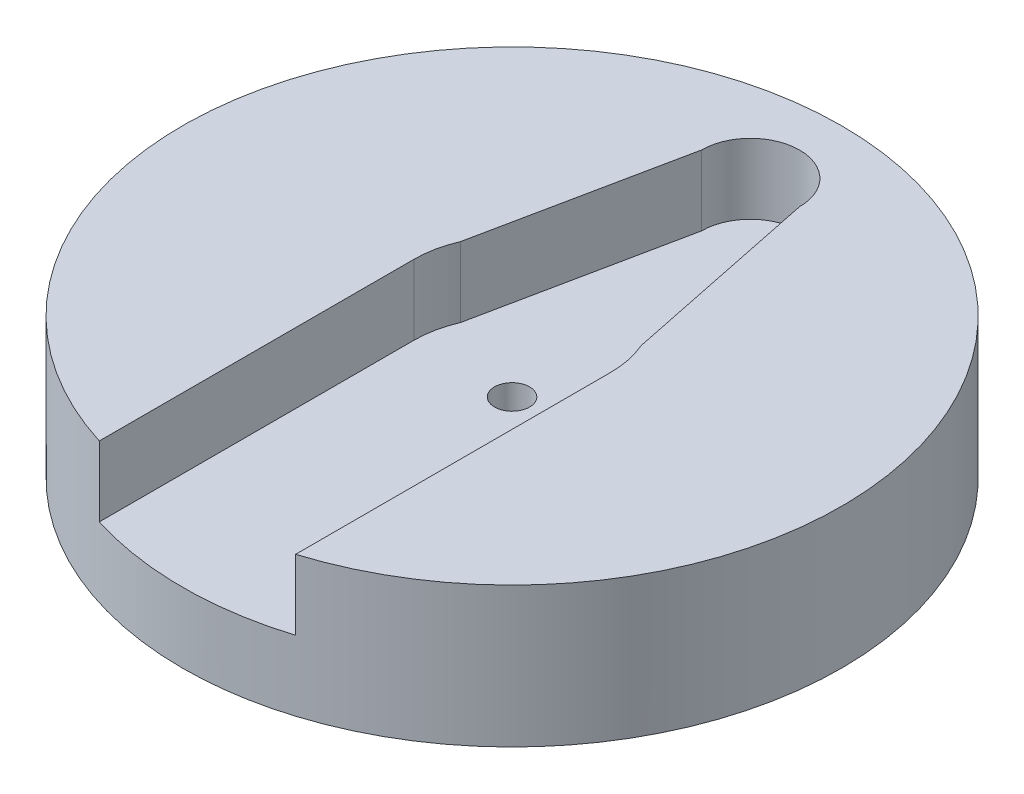
ISO-10303-21;
HEADER;
FILE_DESCRIPTION(('STEP AP214'),'2;1');
FILE_NAME('part.step','',(''),(''),'','','');
FILE_SCHEMA(('AUTOMOTIVE_DESIGN { 1 0 10303 214 1 1 1 1 }'));
ENDSEC;
DATA;
#1=APPLICATION_CONTEXT('core data for automotive mechanical design processes');
#2=APPLICATION_PROTOCOL_DEFINITION('international standard','automotive_design',2000,#1);
#3=PRODUCT_CONTEXT('',#1,'mechanical');
#4=PRODUCT('Part','Part','',(#3));
#5=PRODUCT_RELATED_PRODUCT_CATEGORY('part','',(#4));
#6=PRODUCT_DEFINITION_FORMATION('','',#4);
#7=PRODUCT_DEFINITION_CONTEXT('part definition',#1,'design');
#8=PRODUCT_DEFINITION('design','',#6,#7);
#9=PRODUCT_DEFINITION_SHAPE('','',#8);
#10=(LENGTH_UNIT() NAMED_UNIT(*) SI_UNIT(.MILLI.,.METRE.));
#11=(NAMED_UNIT(*) PLANE_ANGLE_UNIT() SI_UNIT($,.RADIAN.));
#12=(NAMED_UNIT(*) SI_UNIT($,.STERADIAN.) SOLID_ANGLE_UNIT());
#13=UNCERTAINTY_MEASURE_WITH_UNIT(LENGTH_MEASURE(1.E-05),#10,'distance_accuracy_value','');
#14=(GEOMETRIC_REPRESENTATION_CONTEXT(3) GLOBAL_UNCERTAINTY_ASSIGNED_CONTEXT((#13)) GLOBAL_UNIT_ASSIGNED_CONTEXT((#10,
#11,#12)) REPRESENTATION_CONTEXT('',''));
#15=CARTESIAN_POINT('',(0.,0.,0.));
#16=DIRECTION('',(0.,0.,1.));
#17=DIRECTION('',(1.,0.,0.));
#18=AXIS2_PLACEMENT_3D('',#15,#16,#17);
#19=CARTESIAN_POINT('',(0.,-3.53553390593274,0.));
#20=DIRECTION('',(0.,1.,0.));
#21=DIRECTION('',(0.,0.,1.));
#22=AXIS2_PLACEMENT_3D('',#19,#20,#21);
#23=CYLINDRICAL_SURFACE('',#22,1.25);
#24=CARTESIAN_POINT('',(0.,5.,0.));
#25=DIRECTION('',(0.,1.,0.));
#26=DIRECTION('',(0.,0.,1.));
#27=AXIS2_PLACEMENT_3D('',#24,#25,#26);
#28=CIRCLE('',#27,1.25);
#29=CARTESIAN_POINT('',(0.,5.,1.25));
#30=VERTEX_POINT('',#29);
#31=EDGE_CURVE('E199',#30,#30,#28,.T.);
#32=ORIENTED_EDGE('',*,*,#31,.T.);
#33=EDGE_LOOP('',(#32));
#34=FACE_BOUND('',#33,.T.);
#35=CARTESIAN_POINT('',(0.,2.,0.));
#36=DIRECTION('',(0.,-1.,0.));
#37=DIRECTION('',(0.,0.,-1.));
#38=AXIS2_PLACEMENT_3D('',#35,#36,#37);
#39=CIRCLE('',#38,1.25);
#40=CARTESIAN_POINT('',(0.,2.,-1.25));
#41=VERTEX_POINT('',#40);
#42=EDGE_CURVE('E47',#41,#41,#39,.F.);
#43=ORIENTED_EDGE('',*,*,#42,.F.);
#44=EDGE_LOOP('',(#43));
#45=FACE_BOUND('',#44,.T.);
#46=ADVANCED_FACE('F43',(#34,#45),#23,.F.);
#47=CARTESIAN_POINT('',(0.,10.,0.));
#48=DIRECTION('',(0.,-1.,0.));
#49=DIRECTION('',(0.,0.,-1.));
#50=AXIS2_PLACEMENT_3D('',#47,#48,#49);
#51=CYLINDRICAL_SURFACE('',#50,23.5);
#52=CARTESIAN_POINT('',(0.,0.,0.));
#53=DIRECTION('',(0.,1.,0.));
#54=DIRECTION('',(0.,0.,1.));
#55=AXIS2_PLACEMENT_3D('',#52,#53,#54);
#56=CIRCLE('',#55,23.5);
#57=CARTESIAN_POINT('',(0.,0.,23.5));
#58=VERTEX_POINT('',#57);
#59=EDGE_CURVE('E52',#58,#58,#56,.T.);
#60=ORIENTED_EDGE('',*,*,#59,.T.);
#61=EDGE_LOOP('',(#60));
#62=FACE_BOUND('',#61,.T.);
#63=DIRECTION('',(0.,1.,0.));
#64=VECTOR('',#63,1.);
#65=CARTESIAN_POINT('',(7.,5.,22.4332342741746));
#66=LINE('',#65,#64);
#67=CARTESIAN_POINT('',(7.,5.,22.4332342741746));
#68=VERTEX_POINT('',#67);
#69=CARTESIAN_POINT('',(7.,10.,22.4332342741746));
#70=VERTEX_POINT('',#69);
#71=EDGE_CURVE('E225',#68,#70,#66,.T.);
#72=ORIENTED_EDGE('',*,*,#71,.F.);
#73=CARTESIAN_POINT('',(0.,5.,0.));
#74=DIRECTION('',(0.,1.,0.));
#75=DIRECTION('',(0.,0.,1.));
#76=AXIS2_PLACEMENT_3D('',#73,#74,#75);
#77=CIRCLE('',#76,23.5);
#78=CARTESIAN_POINT('',(-7.,5.,22.4332342741746));
#79=VERTEX_POINT('',#78);
#80=EDGE_CURVE('E180',#79,#68,#77,.T.);
#81=ORIENTED_EDGE('',*,*,#80,.F.);
#82=DIRECTION('',(0.,1.,0.));
#83=VECTOR('',#82,1.);
#84=CARTESIAN_POINT('',(-7.,5.,22.4332342741746));
#85=LINE('',#84,#83);
#86=CARTESIAN_POINT('',(-7.,10.,22.4332342741746));
#87=VERTEX_POINT('',#86);
#88=EDGE_CURVE('E227',#79,#87,#85,.T.);
#89=ORIENTED_EDGE('',*,*,#88,.T.);
#90=CARTESIAN_POINT('',(0.,10.,0.));
#91=DIRECTION('',(0.,1.,0.));
#92=DIRECTION('',(0.,0.,1.));
#93=AXIS2_PLACEMENT_3D('',#90,#91,#92);
#94=CIRCLE('',#93,23.5);
#95=EDGE_CURVE('E11',#70,#87,#94,.T.);
#96=ORIENTED_EDGE('',*,*,#95,.F.);
#97=EDGE_LOOP('',(#72,#81,#89,#96));
#98=FACE_BOUND('',#97,.T.);
#99=ADVANCED_FACE('F45',(#62,#98),#51,.T.);
#100=CARTESIAN_POINT('',(0.,10.,0.));
#101=DIRECTION('',(0.,1.,0.));
#102=DIRECTION('',(0.,0.,1.));
#103=AXIS2_PLACEMENT_3D('',#100,#101,#102);
#104=PLANE('',#103);
#105=CARTESIAN_POINT('',(0.,10.,0.));
#106=DIRECTION('',(0.,1.,0.));
#107=DIRECTION('',(0.,0.,1.));
#108=AXIS2_PLACEMENT_3D('',#105,#106,#107);
#109=CIRCLE('',#108,7.);
#110=CARTESIAN_POINT('',(7.,10.,0.));
#111=VERTEX_POINT('',#110);
#112=CARTESIAN_POINT('',(6.43070539419088,10.,-2.76514522821576));
#113=VERTEX_POINT('',#112);
#114=EDGE_CURVE('E204',#111,#113,#109,.T.);
#115=ORIENTED_EDGE('',*,*,#114,.F.);
#116=DIRECTION('',(0.,0.,1.));
#117=VECTOR('',#116,1.);
#118=CARTESIAN_POINT('',(7.,10.,0.));
#119=LINE('',#118,#117);
#120=EDGE_CURVE('E201',#111,#70,#119,.T.);
#121=ORIENTED_EDGE('',*,*,#120,.T.);
#122=ORIENTED_EDGE('',*,*,#95,.T.);
#123=DIRECTION('',(0.,0.,1.));
#124=VECTOR('',#123,1.);
#125=CARTESIAN_POINT('',(-7.,10.,0.));
#126=LINE('',#125,#124);
#127=CARTESIAN_POINT('',(-7.,10.,0.));
#128=VERTEX_POINT('',#127);
#129=EDGE_CURVE('E198',#128,#87,#126,.T.);
#130=ORIENTED_EDGE('',*,*,#129,.F.);
#131=CARTESIAN_POINT('',(0.,10.,0.));
#132=DIRECTION('',(0.,1.,0.));
#133=DIRECTION('',(0.,0.,1.));
#134=AXIS2_PLACEMENT_3D('',#131,#132,#133);
#135=CIRCLE('',#134,7.);
#136=CARTESIAN_POINT('',(-6.43070539419087,10.,-2.76514522821576));
#137=VERTEX_POINT('',#136);
#138=EDGE_CURVE('E68',#137,#128,#135,.T.);
#139=ORIENTED_EDGE('',*,*,#138,.F.);
#140=DIRECTION('',(-0.201652920670487,0.,0.979457043256652));
#141=VECTOR('',#140,1.);
#142=CARTESIAN_POINT('',(-6.71535269709544,10.,-1.38257261410788));
#143=LINE('',#142,#141);
#144=CARTESIAN_POINT('',(-3.5,10.,-17.));
#145=VERTEX_POINT('',#144);
#146=EDGE_CURVE('E177',#145,#137,#143,.T.);
#147=ORIENTED_EDGE('',*,*,#146,.F.);
#148=CARTESIAN_POINT('',(0.,10.,-17.));
#149=DIRECTION('',(0.,1.,0.));
#150=DIRECTION('',(0.,0.,1.));
#151=AXIS2_PLACEMENT_3D('',#148,#149,#150);
#152=CIRCLE('',#151,3.5);
#153=CARTESIAN_POINT('',(3.5,10.,-17.));
#154=VERTEX_POINT('',#153);
#155=EDGE_CURVE('E210',#154,#145,#152,.T.);
#156=ORIENTED_EDGE('',*,*,#155,.F.);
#157=DIRECTION('',(0.201652920670487,0.,0.979457043256652));
#158=VECTOR('',#157,1.);
#159=CARTESIAN_POINT('',(6.71535269709544,10.,-1.38257261410788));
#160=LINE('',#159,#158);
#161=EDGE_CURVE('E207',#154,#113,#160,.T.);
#162=ORIENTED_EDGE('',*,*,#161,.T.);
#163=EDGE_LOOP('',(#115,#121,#122,#130,#139,#147,#156,#162));
#164=FACE_BOUND('',#163,.T.);
#165=ADVANCED_FACE('F245',(#164),#104,.T.);
#166=CARTESIAN_POINT('',(0.,0.,0.));
#167=DIRECTION('',(0.,1.,0.));
#168=DIRECTION('',(0.,0.,1.));
#169=AXIS2_PLACEMENT_3D('',#166,#167,#168);
#170=PLANE('',#169);
#171=DIRECTION('',(1.,0.,0.));
#172=VECTOR('',#171,1.);
#173=CARTESIAN_POINT('',(-7.5,0.,-2.5));
#174=LINE('',#173,#172);
#175=CARTESIAN_POINT('',(-7.5,0.,-2.5));
#176=VERTEX_POINT('',#175);
#177=CARTESIAN_POINT('',(7.5,0.,-2.5));
#178=VERTEX_POINT('',#177);
#179=EDGE_CURVE('E164',#176,#178,#174,.T.);
#180=ORIENTED_EDGE('',*,*,#179,.F.);
#181=CARTESIAN_POINT('',(-7.5,0.,0.));
#182=DIRECTION('',(0.,-1.,0.));
#183=DIRECTION('',(0.,0.,-1.));
#184=AXIS2_PLACEMENT_3D('',#181,#182,#183);
#185=CIRCLE('',#184,2.5);
#186=CARTESIAN_POINT('',(-7.5,0.,2.5));
#187=VERTEX_POINT('',#186);
#188=EDGE_CURVE('E60',#187,#176,#185,.T.);
#189=ORIENTED_EDGE('',*,*,#188,.F.);
#190=DIRECTION('',(-1.,0.,0.));
#191=VECTOR('',#190,1.);
#192=CARTESIAN_POINT('',(-7.5,0.,2.5));
#193=LINE('',#192,#191);
#194=CARTESIAN_POINT('',(7.5,0.,2.5));
#195=VERTEX_POINT('',#194);
#196=EDGE_CURVE('E155',#195,#187,#193,.T.);
#197=ORIENTED_EDGE('',*,*,#196,.F.);
#198=CARTESIAN_POINT('',(7.5,0.,0.));
#199=DIRECTION('',(0.,-1.,0.));
#200=DIRECTION('',(0.,0.,-1.));
#201=AXIS2_PLACEMENT_3D('',#198,#199,#200);
#202=CIRCLE('',#201,2.5);
#203=EDGE_CURVE('E158',#178,#195,#202,.T.);
#204=ORIENTED_EDGE('',*,*,#203,.F.);
#205=EDGE_LOOP('',(#180,#189,#197,#204));
#206=FACE_BOUND('',#205,.T.);
#207=ORIENTED_EDGE('',*,*,#59,.F.);
#208=EDGE_LOOP('',(#207));
#209=FACE_BOUND('',#208,.T.);
#210=ADVANCED_FACE('F280',(#206,#209),#170,.F.);
#211=CARTESIAN_POINT('',(0.,5.,0.));
#212=DIRECTION('',(0.,1.,0.));
#213=DIRECTION('',(0.,0.,1.));
#214=AXIS2_PLACEMENT_3D('',#211,#212,#213);
#215=CYLINDRICAL_SURFACE('',#214,7.);
#216=ORIENTED_EDGE('',*,*,#138,.T.);
#217=DIRECTION('',(0.,1.,0.));
#218=VECTOR('',#217,1.);
#219=CARTESIAN_POINT('',(-7.,5.,0.));
#220=LINE('',#219,#218);
#221=CARTESIAN_POINT('',(-7.,5.,0.));
#222=VERTEX_POINT('',#221);
#223=EDGE_CURVE('E196',#222,#128,#220,.T.);
#224=ORIENTED_EDGE('',*,*,#223,.F.);
#225=CARTESIAN_POINT('',(0.,5.,0.));
#226=DIRECTION('',(0.,1.,0.));
#227=DIRECTION('',(0.,0.,1.));
#228=AXIS2_PLACEMENT_3D('',#225,#226,#227);
#229=CIRCLE('',#228,7.);
#230=CARTESIAN_POINT('',(-6.43070539419087,5.,-2.76514522821576));
#231=VERTEX_POINT('',#230);
#232=EDGE_CURVE('E173',#231,#222,#229,.T.);
#233=ORIENTED_EDGE('',*,*,#232,.F.);
#234=DIRECTION('',(0.,1.,0.));
#235=VECTOR('',#234,1.);
#236=CARTESIAN_POINT('',(-6.43070539419087,5.,-2.76514522821576));
#237=LINE('',#236,#235);
#238=EDGE_CURVE('E215',#231,#137,#237,.T.);
#239=ORIENTED_EDGE('',*,*,#238,.T.);
#240=EDGE_LOOP('',(#216,#224,#233,#239));
#241=FACE_BOUND('',#240,.T.);
#242=ADVANCED_FACE('F258',(#241),#215,.F.);
#243=CARTESIAN_POINT('',(-6.71535269709544,5.,-1.38257261410788));
#244=DIRECTION('',(-0.979457043256652,0.,-0.201652920670487));
#245=DIRECTION('',(-0.201652920670487,0.,0.979457043256652));
#246=AXIS2_PLACEMENT_3D('',#243,#244,#245);
#247=PLANE('',#246);
#248=ORIENTED_EDGE('',*,*,#146,.T.);
#249=ORIENTED_EDGE('',*,*,#238,.F.);
#250=DIRECTION('',(-0.201652920670487,0.,0.979457043256652));
#251=VECTOR('',#250,1.);
#252=CARTESIAN_POINT('',(-6.71535269709544,5.,-1.38257261410788));
#253=LINE('',#252,#251);
#254=CARTESIAN_POINT('',(-3.5,5.,-17.));
#255=VERTEX_POINT('',#254);
#256=EDGE_CURVE('E193',#255,#231,#253,.T.);
#257=ORIENTED_EDGE('',*,*,#256,.F.);
#258=DIRECTION('',(0.,1.,0.));
#259=VECTOR('',#258,1.);
#260=CARTESIAN_POINT('',(-3.5,5.,-17.));
#261=LINE('',#260,#259);
#262=EDGE_CURVE('E217',#255,#145,#261,.T.);
#263=ORIENTED_EDGE('',*,*,#262,.T.);
#264=EDGE_LOOP('',(#248,#249,#257,#263));
#265=FACE_BOUND('',#264,.T.);
#266=ADVANCED_FACE('F254',(#265),#247,.F.);
#267=CARTESIAN_POINT('',(0.,5.,-17.));
#268=DIRECTION('',(0.,1.,0.));
#269=DIRECTION('',(0.,0.,1.));
#270=AXIS2_PLACEMENT_3D('',#267,#268,#269);
#271=CYLINDRICAL_SURFACE('',#270,3.5);
#272=ORIENTED_EDGE('',*,*,#155,.T.);
#273=ORIENTED_EDGE('',*,*,#262,.F.);
#274=CARTESIAN_POINT('',(0.,5.,-17.));
#275=DIRECTION('',(0.,1.,0.));
#276=DIRECTION('',(0.,0.,1.));
#277=AXIS2_PLACEMENT_3D('',#274,#275,#276);
#278=CIRCLE('',#277,3.5);
#279=CARTESIAN_POINT('',(3.5,5.,-17.));
#280=VERTEX_POINT('',#279);
#281=EDGE_CURVE('E190',#280,#255,#278,.T.);
#282=ORIENTED_EDGE('',*,*,#281,.F.);
#283=DIRECTION('',(0.,1.,0.));
#284=VECTOR('',#283,1.);
#285=CARTESIAN_POINT('',(3.5,5.,-17.));
#286=LINE('',#285,#284);
#287=EDGE_CURVE('E219',#280,#154,#286,.T.);
#288=ORIENTED_EDGE('',*,*,#287,.T.);
#289=EDGE_LOOP('',(#272,#273,#282,#288));
#290=FACE_BOUND('',#289,.T.);
#291=ADVANCED_FACE('F257',(#290),#271,.F.);
#292=CARTESIAN_POINT('',(6.71535269709544,5.,-1.38257261410788));
#293=DIRECTION('',(-0.979457043256651,0.,0.201652920670487));
#294=DIRECTION('',(0.201652920670487,0.,0.979457043256652));
#295=AXIS2_PLACEMENT_3D('',#292,#293,#294);
#296=PLANE('',#295);
#297=ORIENTED_EDGE('',*,*,#161,.F.);
#298=ORIENTED_EDGE('',*,*,#287,.F.);
#299=DIRECTION('',(0.201652920670487,0.,0.979457043256652));
#300=VECTOR('',#299,1.);
#301=CARTESIAN_POINT('',(6.71535269709544,5.,-1.38257261410788));
#302=LINE('',#301,#300);
#303=CARTESIAN_POINT('',(6.43070539419088,5.,-2.76514522821576));
#304=VERTEX_POINT('',#303);
#305=EDGE_CURVE('E188',#280,#304,#302,.T.);
#306=ORIENTED_EDGE('',*,*,#305,.T.);
#307=DIRECTION('',(0.,1.,0.));
#308=VECTOR('',#307,1.);
#309=CARTESIAN_POINT('',(6.43070539419088,5.,-2.76514522821576));
#310=LINE('',#309,#308);
#311=EDGE_CURVE('E221',#304,#113,#310,.T.);
#312=ORIENTED_EDGE('',*,*,#311,.T.);
#313=EDGE_LOOP('',(#297,#298,#306,#312));
#314=FACE_BOUND('',#313,.T.);
#315=ADVANCED_FACE('F262',(#314),#296,.T.);
#316=CARTESIAN_POINT('',(0.,5.,0.));
#317=DIRECTION('',(0.,1.,0.));
#318=DIRECTION('',(0.,0.,1.));
#319=AXIS2_PLACEMENT_3D('',#316,#317,#318);
#320=CYLINDRICAL_SURFACE('',#319,7.);
#321=ORIENTED_EDGE('',*,*,#114,.T.);
#322=ORIENTED_EDGE('',*,*,#311,.F.);
#323=CARTESIAN_POINT('',(0.,5.,0.));
#324=DIRECTION('',(0.,1.,0.));
#325=DIRECTION('',(0.,0.,1.));
#326=AXIS2_PLACEMENT_3D('',#323,#324,#325);
#327=CIRCLE('',#326,7.);
#328=CARTESIAN_POINT('',(7.,5.,0.));
#329=VERTEX_POINT('',#328);
#330=EDGE_CURVE('E185',#329,#304,#327,.T.);
#331=ORIENTED_EDGE('',*,*,#330,.F.);
#332=DIRECTION('',(0.,1.,0.));
#333=VECTOR('',#332,1.);
#334=CARTESIAN_POINT('',(7.,5.,0.));
#335=LINE('',#334,#333);
#336=EDGE_CURVE('E223',#329,#111,#335,.T.);
#337=ORIENTED_EDGE('',*,*,#336,.T.);
#338=EDGE_LOOP('',(#321,#322,#331,#337));
#339=FACE_BOUND('',#338,.T.);
#340=ADVANCED_FACE('F266',(#339),#320,.F.);
#341=CARTESIAN_POINT('',(7.,5.,0.));
#342=DIRECTION('',(-1.,0.,0.));
#343=DIRECTION('',(0.,0.,1.));
#344=AXIS2_PLACEMENT_3D('',#341,#342,#343);
#345=PLANE('',#344);
#346=ORIENTED_EDGE('',*,*,#120,.F.);
#347=ORIENTED_EDGE('',*,*,#336,.F.);
#348=DIRECTION('',(0.,0.,1.));
#349=VECTOR('',#348,1.);
#350=CARTESIAN_POINT('',(7.,5.,0.));
#351=LINE('',#350,#349);
#352=EDGE_CURVE('E183',#329,#68,#351,.T.);
#353=ORIENTED_EDGE('',*,*,#352,.T.);
#354=ORIENTED_EDGE('',*,*,#71,.T.);
#355=EDGE_LOOP('',(#346,#347,#353,#354));
#356=FACE_BOUND('',#355,.T.);
#357=ADVANCED_FACE('F270',(#356),#345,.T.);
#358=CARTESIAN_POINT('',(-7.,5.,0.));
#359=DIRECTION('',(-1.,0.,0.));
#360=DIRECTION('',(0.,0.,1.));
#361=AXIS2_PLACEMENT_3D('',#358,#359,#360);
#362=PLANE('',#361);
#363=ORIENTED_EDGE('',*,*,#129,.T.);
#364=ORIENTED_EDGE('',*,*,#88,.F.);
#365=DIRECTION('',(0.,0.,1.));
#366=VECTOR('',#365,1.);
#367=CARTESIAN_POINT('',(-7.,5.,0.));
#368=LINE('',#367,#366);
#369=EDGE_CURVE('E176',#222,#79,#368,.T.);
#370=ORIENTED_EDGE('',*,*,#369,.F.);
#371=ORIENTED_EDGE('',*,*,#223,.T.);
#372=EDGE_LOOP('',(#363,#364,#370,#371));
#373=FACE_BOUND('',#372,.T.);
#374=ADVANCED_FACE('F252',(#373),#362,.F.);
#375=CARTESIAN_POINT('',(0.,5.,0.));
#376=DIRECTION('',(0.,1.,0.));
#377=DIRECTION('',(0.,0.,1.));
#378=AXIS2_PLACEMENT_3D('',#375,#376,#377);
#379=PLANE('',#378);
#380=ORIENTED_EDGE('',*,*,#31,.F.);
#381=EDGE_LOOP('',(#380));
#382=FACE_BOUND('',#381,.T.);
#383=ORIENTED_EDGE('',*,*,#232,.T.);
#384=ORIENTED_EDGE('',*,*,#369,.T.);
#385=ORIENTED_EDGE('',*,*,#80,.T.);
#386=ORIENTED_EDGE('',*,*,#352,.F.);
#387=ORIENTED_EDGE('',*,*,#330,.T.);
#388=ORIENTED_EDGE('',*,*,#305,.F.);
#389=ORIENTED_EDGE('',*,*,#281,.T.);
#390=ORIENTED_EDGE('',*,*,#256,.T.);
#391=EDGE_LOOP('',(#383,#384,#385,#386,#387,#388,#389,#390));
#392=FACE_BOUND('',#391,.T.);
#393=ADVANCED_FACE('F250',(#382,#392),#379,.T.);
#394=CARTESIAN_POINT('',(-7.5,2.,0.));
#395=DIRECTION('',(0.,-1.,0.));
#396=DIRECTION('',(0.,0.,-1.));
#397=AXIS2_PLACEMENT_3D('',#394,#395,#396);
#398=PLANE('',#397);
#399=CARTESIAN_POINT('',(-7.5,2.,0.));
#400=DIRECTION('',(0.,-1.,0.));
#401=DIRECTION('',(0.,0.,-1.));
#402=AXIS2_PLACEMENT_3D('',#399,#400,#401);
#403=CIRCLE('',#402,2.5);
#404=CARTESIAN_POINT('',(-7.5,2.,2.5));
#405=VERTEX_POINT('',#404);
#406=CARTESIAN_POINT('',(-7.5,2.,-2.5));
#407=VERTEX_POINT('',#406);
#408=EDGE_CURVE('E136',#405,#407,#403,.T.);
#409=ORIENTED_EDGE('',*,*,#408,.T.);
#410=DIRECTION('',(1.,0.,0.));
#411=VECTOR('',#410,1.);
#412=CARTESIAN_POINT('',(-7.5,2.,-2.5));
#413=LINE('',#412,#411);
#414=CARTESIAN_POINT('',(7.5,2.,-2.5));
#415=VERTEX_POINT('',#414);
#416=EDGE_CURVE('E145',#407,#415,#413,.T.);
#417=ORIENTED_EDGE('',*,*,#416,.T.);
#418=CARTESIAN_POINT('',(7.5,2.,0.));
#419=DIRECTION('',(0.,-1.,0.));
#420=DIRECTION('',(0.,0.,-1.));
#421=AXIS2_PLACEMENT_3D('',#418,#419,#420);
#422=CIRCLE('',#421,2.5);
#423=CARTESIAN_POINT('',(7.5,2.,2.5));
#424=VERTEX_POINT('',#423);
#425=EDGE_CURVE('E150',#415,#424,#422,.T.);
#426=ORIENTED_EDGE('',*,*,#425,.T.);
#427=DIRECTION('',(-1.,0.,0.));
#428=VECTOR('',#427,1.);
#429=CARTESIAN_POINT('',(-7.5,2.,2.5));
#430=LINE('',#429,#428);
#431=EDGE_CURVE('E142',#424,#405,#430,.T.);
#432=ORIENTED_EDGE('',*,*,#431,.T.);
#433=EDGE_LOOP('',(#409,#417,#426,#432));
#434=FACE_BOUND('',#433,.T.);
#435=ORIENTED_EDGE('',*,*,#42,.T.);
#436=EDGE_LOOP('',(#435));
#437=FACE_BOUND('',#436,.T.);
#438=ADVANCED_FACE('F152',(#434,#437),#398,.T.);
#439=CARTESIAN_POINT('',(-7.5,2.,0.));
#440=DIRECTION('',(0.,-1.,0.));
#441=DIRECTION('',(0.,0.,-1.));
#442=AXIS2_PLACEMENT_3D('',#439,#440,#441);
#443=CYLINDRICAL_SURFACE('',#442,2.5);
#444=ORIENTED_EDGE('',*,*,#188,.T.);
#445=DIRECTION('',(0.,-1.,0.));
#446=VECTOR('',#445,1.);
#447=CARTESIAN_POINT('',(-7.5,2.,-2.5));
#448=LINE('',#447,#446);
#449=EDGE_CURVE('E132',#407,#176,#448,.T.);
#450=ORIENTED_EDGE('',*,*,#449,.F.);
#451=ORIENTED_EDGE('',*,*,#408,.F.);
#452=DIRECTION('',(0.,-1.,0.));
#453=VECTOR('',#452,1.);
#454=CARTESIAN_POINT('',(-7.5,2.,2.5));
#455=LINE('',#454,#453);
#456=EDGE_CURVE('E168',#405,#187,#455,.T.);
#457=ORIENTED_EDGE('',*,*,#456,.T.);
#458=EDGE_LOOP('',(#444,#450,#451,#457));
#459=FACE_BOUND('',#458,.T.);
#460=ADVANCED_FACE('F134',(#459),#443,.F.);
#461=CARTESIAN_POINT('',(-7.5,2.,2.5));
#462=DIRECTION('',(0.,0.,1.));
#463=DIRECTION('',(1.,0.,0.));
#464=AXIS2_PLACEMENT_3D('',#461,#462,#463);
#465=PLANE('',#464);
#466=ORIENTED_EDGE('',*,*,#196,.T.);
#467=ORIENTED_EDGE('',*,*,#456,.F.);
#468=ORIENTED_EDGE('',*,*,#431,.F.);
#469=DIRECTION('',(0.,-1.,0.));
#470=VECTOR('',#469,1.);
#471=CARTESIAN_POINT('',(7.5,2.,2.5));
#472=LINE('',#471,#470);
#473=EDGE_CURVE('E170',#424,#195,#472,.T.);
#474=ORIENTED_EDGE('',*,*,#473,.T.);
#475=EDGE_LOOP('',(#466,#467,#468,#474));
#476=FACE_BOUND('',#475,.T.);
#477=ADVANCED_FACE('F313',(#476),#465,.F.);
#478=CARTESIAN_POINT('',(7.5,2.,0.));
#479=DIRECTION('',(0.,-1.,0.));
#480=DIRECTION('',(0.,0.,-1.));
#481=AXIS2_PLACEMENT_3D('',#478,#479,#480);
#482=CYLINDRICAL_SURFACE('',#481,2.5);
#483=ORIENTED_EDGE('',*,*,#203,.T.);
#484=ORIENTED_EDGE('',*,*,#473,.F.);
#485=ORIENTED_EDGE('',*,*,#425,.F.);
#486=DIRECTION('',(0.,-1.,0.));
#487=VECTOR('',#486,1.);
#488=CARTESIAN_POINT('',(7.5,2.,-2.5));
#489=LINE('',#488,#487);
#490=EDGE_CURVE('E141',#415,#178,#489,.T.);
#491=ORIENTED_EDGE('',*,*,#490,.T.);
#492=EDGE_LOOP('',(#483,#484,#485,#491));
#493=FACE_BOUND('',#492,.T.);
#494=ADVANCED_FACE('F311',(#493),#482,.F.);
#495=CARTESIAN_POINT('',(-7.5,2.,-2.5));
#496=DIRECTION('',(0.,0.,-1.));
#497=DIRECTION('',(-1.,0.,0.));
#498=AXIS2_PLACEMENT_3D('',#495,#496,#497);
#499=PLANE('',#498);
#500=ORIENTED_EDGE('',*,*,#179,.T.);
#501=ORIENTED_EDGE('',*,*,#490,.F.);
#502=ORIENTED_EDGE('',*,*,#416,.F.);
#503=ORIENTED_EDGE('',*,*,#449,.T.);
#504=EDGE_LOOP('',(#500,#501,#502,#503));
#505=FACE_BOUND('',#504,.T.);
#506=ADVANCED_FACE('F146',(#505),#499,.F.);
#507=CLOSED_SHELL('',(#46,#99,#165,#210,#242,#266,#291,#315,#340,#357,#374,#393,#438,#460,#477,
#494,#506));
#508=MANIFOLD_SOLID_BREP('B2',#507);
#509=ADVANCED_BREP_SHAPE_REPRESENTATION('',(#18,#508),#14);
#510=SHAPE_DEFINITION_REPRESENTATION(#9,#509);
ENDSEC;
END-ISO-10303-21;
